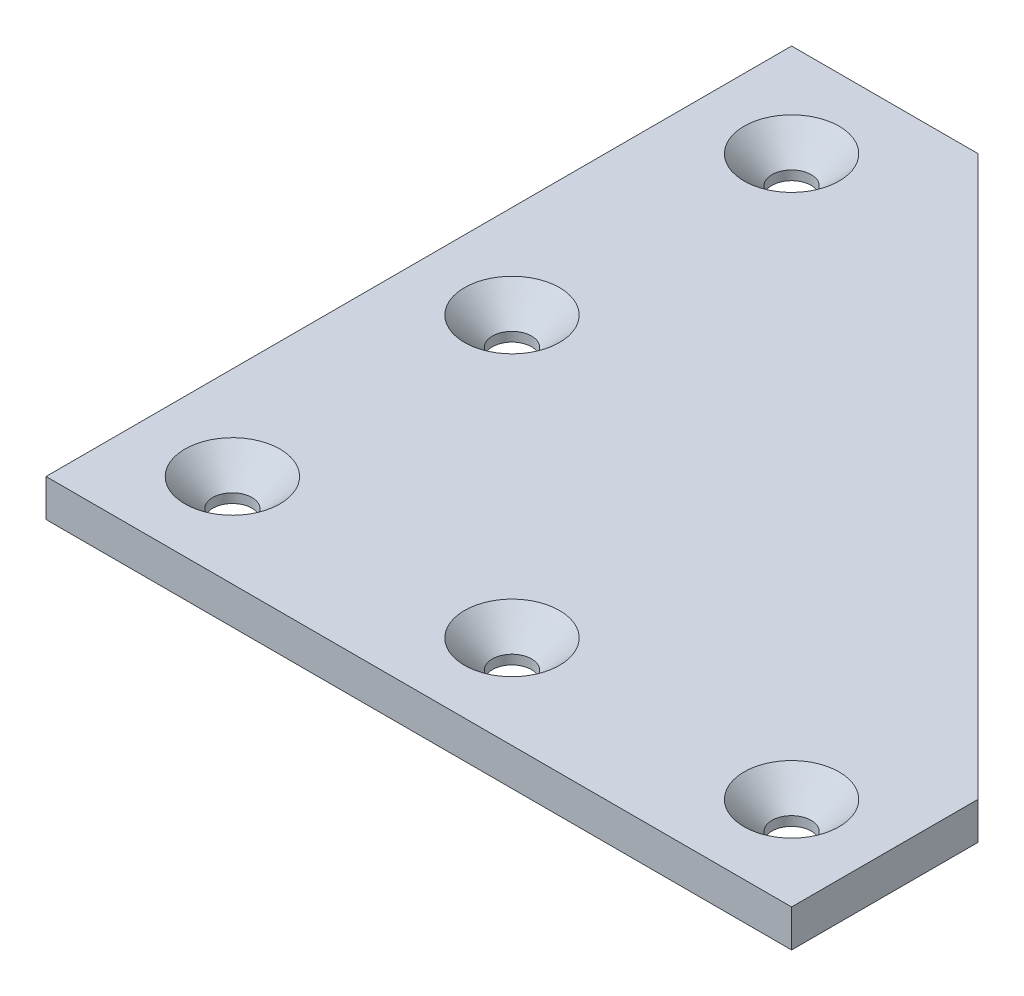
ISO-10303-21;
HEADER;
FILE_DESCRIPTION(('STEP AP214'),'2;1');
FILE_NAME('part.step','',(''),(''),'','','');
FILE_SCHEMA(('AUTOMOTIVE_DESIGN { 1 0 10303 214 1 1 1 1 }'));
ENDSEC;
DATA;
#1=APPLICATION_CONTEXT('core data for automotive mechanical design processes');
#2=APPLICATION_PROTOCOL_DEFINITION('international standard','automotive_design',2000,#1);
#3=PRODUCT_CONTEXT('',#1,'mechanical');
#4=PRODUCT('Part','Part','',(#3));
#5=PRODUCT_RELATED_PRODUCT_CATEGORY('part','',(#4));
#6=PRODUCT_DEFINITION_FORMATION('','',#4);
#7=PRODUCT_DEFINITION_CONTEXT('part definition',#1,'design');
#8=PRODUCT_DEFINITION('design','',#6,#7);
#9=PRODUCT_DEFINITION_SHAPE('','',#8);
#10=(LENGTH_UNIT() NAMED_UNIT(*) SI_UNIT(.MILLI.,.METRE.));
#11=(NAMED_UNIT(*) PLANE_ANGLE_UNIT() SI_UNIT($,.RADIAN.));
#12=(NAMED_UNIT(*) SI_UNIT($,.STERADIAN.) SOLID_ANGLE_UNIT());
#13=UNCERTAINTY_MEASURE_WITH_UNIT(LENGTH_MEASURE(1.E-05),#10,'distance_accuracy_value','');
#14=(GEOMETRIC_REPRESENTATION_CONTEXT(3) GLOBAL_UNCERTAINTY_ASSIGNED_CONTEXT((#13)) GLOBAL_UNIT_ASSIGNED_CONTEXT((#10,
#11,#12)) REPRESENTATION_CONTEXT('',''));
#15=CARTESIAN_POINT('',(0.,0.,0.));
#16=DIRECTION('',(0.,0.,1.));
#17=DIRECTION('',(1.,0.,0.));
#18=AXIS2_PLACEMENT_3D('',#15,#16,#17);
#19=CARTESIAN_POINT('',(80.,4.,0.));
#20=DIRECTION('',(0.,0.,-1.));
#21=DIRECTION('',(-1.,0.,0.));
#22=AXIS2_PLACEMENT_3D('',#19,#20,#21);
#23=PLANE('',#22);
#24=DIRECTION('',(1.,0.,0.));
#25=VECTOR('',#24,1.);
#26=CARTESIAN_POINT('',(80.,0.,0.));
#27=LINE('',#26,#25);
#28=CARTESIAN_POINT('',(0.,0.,0.));
#29=VERTEX_POINT('',#28);
#30=CARTESIAN_POINT('',(80.,0.,0.));
#31=VERTEX_POINT('',#30);
#32=EDGE_CURVE('E128',#29,#31,#27,.T.);
#33=ORIENTED_EDGE('',*,*,#32,.T.);
#34=DIRECTION('',(0.,-1.,0.));
#35=VECTOR('',#34,1.);
#36=CARTESIAN_POINT('',(80.,4.,0.));
#37=LINE('',#36,#35);
#38=CARTESIAN_POINT('',(80.,4.,0.));
#39=VERTEX_POINT('',#38);
#40=EDGE_CURVE('E149',#39,#31,#37,.T.);
#41=ORIENTED_EDGE('',*,*,#40,.F.);
#42=DIRECTION('',(1.,0.,0.));
#43=VECTOR('',#42,1.);
#44=CARTESIAN_POINT('',(80.,4.,0.));
#45=LINE('',#44,#43);
#46=CARTESIAN_POINT('',(0.,4.,0.));
#47=VERTEX_POINT('',#46);
#48=EDGE_CURVE('E142',#47,#39,#45,.T.);
#49=ORIENTED_EDGE('',*,*,#48,.F.);
#50=DIRECTION('',(0.,-1.,0.));
#51=VECTOR('',#50,1.);
#52=CARTESIAN_POINT('',(0.,4.,0.));
#53=LINE('',#52,#51);
#54=EDGE_CURVE('E124',#47,#29,#53,.T.);
#55=ORIENTED_EDGE('',*,*,#54,.T.);
#56=EDGE_LOOP('',(#33,#41,#49,#55));
#57=FACE_BOUND('',#56,.T.);
#58=ADVANCED_FACE('F45',(#57),#23,.F.);
#59=CARTESIAN_POINT('',(80.,4.,-20.));
#60=DIRECTION('',(-1.,0.,0.));
#61=DIRECTION('',(0.,0.,1.));
#62=AXIS2_PLACEMENT_3D('',#59,#60,#61);
#63=PLANE('',#62);
#64=DIRECTION('',(0.,0.,-1.));
#65=VECTOR('',#64,1.);
#66=CARTESIAN_POINT('',(80.,0.,-20.));
#67=LINE('',#66,#65);
#68=CARTESIAN_POINT('',(80.,0.,-20.));
#69=VERTEX_POINT('',#68);
#70=EDGE_CURVE('E132',#31,#69,#67,.T.);
#71=ORIENTED_EDGE('',*,*,#70,.T.);
#72=DIRECTION('',(0.,-1.,0.));
#73=VECTOR('',#72,1.);
#74=CARTESIAN_POINT('',(80.,4.,-20.));
#75=LINE('',#74,#73);
#76=CARTESIAN_POINT('',(80.,4.,-20.));
#77=VERTEX_POINT('',#76);
#78=EDGE_CURVE('E117',#77,#69,#75,.T.);
#79=ORIENTED_EDGE('',*,*,#78,.F.);
#80=DIRECTION('',(0.,0.,-1.));
#81=VECTOR('',#80,1.);
#82=CARTESIAN_POINT('',(80.,4.,-20.));
#83=LINE('',#82,#81);
#84=EDGE_CURVE('E99',#39,#77,#83,.T.);
#85=ORIENTED_EDGE('',*,*,#84,.F.);
#86=ORIENTED_EDGE('',*,*,#40,.T.);
#87=EDGE_LOOP('',(#71,#79,#85,#86));
#88=FACE_BOUND('',#87,.T.);
#89=ADVANCED_FACE('F205',(#88),#63,.F.);
#90=CARTESIAN_POINT('',(20.,4.,-79.9999999999998));
#91=DIRECTION('',(-0.707106781186546,0.,0.707106781186549));
#92=DIRECTION('',(0.707106781186549,0.,0.707106781186546));
#93=AXIS2_PLACEMENT_3D('',#90,#91,#92);
#94=PLANE('',#93);
#95=DIRECTION('',(-0.707106781186549,0.,-0.707106781186546));
#96=VECTOR('',#95,1.);
#97=CARTESIAN_POINT('',(20.,0.,-79.9999999999998));
#98=LINE('',#97,#96);
#99=CARTESIAN_POINT('',(20.,0.,-79.9999999999998));
#100=VERTEX_POINT('',#99);
#101=EDGE_CURVE('E115',#69,#100,#98,.T.);
#102=ORIENTED_EDGE('',*,*,#101,.T.);
#103=DIRECTION('',(0.,-1.,0.));
#104=VECTOR('',#103,1.);
#105=CARTESIAN_POINT('',(20.,4.,-79.9999999999998));
#106=LINE('',#105,#104);
#107=CARTESIAN_POINT('',(20.,4.,-79.9999999999998));
#108=VERTEX_POINT('',#107);
#109=EDGE_CURVE('E112',#108,#100,#106,.T.);
#110=ORIENTED_EDGE('',*,*,#109,.F.);
#111=DIRECTION('',(-0.707106781186549,0.,-0.707106781186546));
#112=VECTOR('',#111,1.);
#113=CARTESIAN_POINT('',(20.,4.,-79.9999999999998));
#114=LINE('',#113,#112);
#115=EDGE_CURVE('E103',#77,#108,#114,.T.);
#116=ORIENTED_EDGE('',*,*,#115,.F.);
#117=ORIENTED_EDGE('',*,*,#78,.T.);
#118=EDGE_LOOP('',(#102,#110,#116,#117));
#119=FACE_BOUND('',#118,.T.);
#120=ADVANCED_FACE('F113',(#119),#94,.F.);
#121=CARTESIAN_POINT('',(0.,4.,-79.9999999999998));
#122=DIRECTION('',(0.,0.,1.));
#123=DIRECTION('',(1.,0.,0.));
#124=AXIS2_PLACEMENT_3D('',#121,#122,#123);
#125=PLANE('',#124);
#126=DIRECTION('',(-1.,0.,0.));
#127=VECTOR('',#126,1.);
#128=CARTESIAN_POINT('',(0.,0.,-79.9999999999998));
#129=LINE('',#128,#127);
#130=CARTESIAN_POINT('',(0.,0.,-79.9999999999998));
#131=VERTEX_POINT('',#130);
#132=EDGE_CURVE('E84',#100,#131,#129,.T.);
#133=ORIENTED_EDGE('',*,*,#132,.T.);
#134=DIRECTION('',(0.,-1.,0.));
#135=VECTOR('',#134,1.);
#136=CARTESIAN_POINT('',(0.,4.,-79.9999999999998));
#137=LINE('',#136,#135);
#138=CARTESIAN_POINT('',(0.,4.,-79.9999999999998));
#139=VERTEX_POINT('',#138);
#140=EDGE_CURVE('E118',#139,#131,#137,.T.);
#141=ORIENTED_EDGE('',*,*,#140,.F.);
#142=DIRECTION('',(-1.,0.,0.));
#143=VECTOR('',#142,1.);
#144=CARTESIAN_POINT('',(0.,4.,-79.9999999999998));
#145=LINE('',#144,#143);
#146=EDGE_CURVE('E107',#108,#139,#145,.T.);
#147=ORIENTED_EDGE('',*,*,#146,.F.);
#148=ORIENTED_EDGE('',*,*,#109,.T.);
#149=EDGE_LOOP('',(#133,#141,#147,#148));
#150=FACE_BOUND('',#149,.T.);
#151=ADVANCED_FACE('F120',(#150),#125,.F.);
#152=CARTESIAN_POINT('',(0.,4.,0.));
#153=DIRECTION('',(1.,0.,0.));
#154=DIRECTION('',(0.,0.,-1.));
#155=AXIS2_PLACEMENT_3D('',#152,#153,#154);
#156=PLANE('',#155);
#157=DIRECTION('',(0.,0.,1.));
#158=VECTOR('',#157,1.);
#159=CARTESIAN_POINT('',(0.,0.,0.));
#160=LINE('',#159,#158);
#161=EDGE_CURVE('E90',#131,#29,#160,.T.);
#162=ORIENTED_EDGE('',*,*,#161,.T.);
#163=ORIENTED_EDGE('',*,*,#54,.F.);
#164=DIRECTION('',(0.,0.,1.));
#165=VECTOR('',#164,1.);
#166=CARTESIAN_POINT('',(0.,4.,0.));
#167=LINE('',#166,#165);
#168=EDGE_CURVE('E64',#139,#47,#167,.T.);
#169=ORIENTED_EDGE('',*,*,#168,.F.);
#170=ORIENTED_EDGE('',*,*,#140,.T.);
#171=EDGE_LOOP('',(#162,#163,#169,#170));
#172=FACE_BOUND('',#171,.T.);
#173=ADVANCED_FACE('F272',(#172),#156,.F.);
#174=CARTESIAN_POINT('',(0.,4.,0.));
#175=DIRECTION('',(0.,-1.,0.));
#176=DIRECTION('',(0.,0.,-1.));
#177=AXIS2_PLACEMENT_3D('',#174,#175,#176);
#178=PLANE('',#177);
#179=CARTESIAN_POINT('',(70.,4.,-10.));
#180=DIRECTION('',(0.,-1.,0.));
#181=DIRECTION('',(0.,0.,-1.));
#182=AXIS2_PLACEMENT_3D('',#179,#180,#181);
#183=CIRCLE('',#182,5.10000000000002);
#184=CARTESIAN_POINT('',(70.,4.,-15.1));
#185=VERTEX_POINT('',#184);
#186=EDGE_CURVE('E172',#185,#185,#183,.T.);
#187=ORIENTED_EDGE('',*,*,#186,.T.);
#188=EDGE_LOOP('',(#187));
#189=FACE_BOUND('',#188,.T.);
#190=CARTESIAN_POINT('',(40.,4.,-10.));
#191=DIRECTION('',(0.,-1.,0.));
#192=DIRECTION('',(0.,0.,-1.));
#193=AXIS2_PLACEMENT_3D('',#190,#191,#192);
#194=CIRCLE('',#193,5.10000000000001);
#195=CARTESIAN_POINT('',(40.,4.,-15.1));
#196=VERTEX_POINT('',#195);
#197=EDGE_CURVE('E168',#196,#196,#194,.T.);
#198=ORIENTED_EDGE('',*,*,#197,.T.);
#199=EDGE_LOOP('',(#198));
#200=FACE_BOUND('',#199,.T.);
#201=CARTESIAN_POINT('',(10.,4.,-10.));
#202=DIRECTION('',(0.,-1.,0.));
#203=DIRECTION('',(0.,0.,-1.));
#204=AXIS2_PLACEMENT_3D('',#201,#202,#203);
#205=CIRCLE('',#204,5.10000000000004);
#206=CARTESIAN_POINT('',(10.,4.,-15.1));
#207=VERTEX_POINT('',#206);
#208=EDGE_CURVE('E164',#207,#207,#205,.T.);
#209=ORIENTED_EDGE('',*,*,#208,.T.);
#210=EDGE_LOOP('',(#209));
#211=FACE_BOUND('',#210,.T.);
#212=CARTESIAN_POINT('',(9.9999999999999,4.,-40.));
#213=DIRECTION('',(0.,-1.,0.));
#214=DIRECTION('',(0.,0.,-1.));
#215=AXIS2_PLACEMENT_3D('',#212,#213,#214);
#216=CIRCLE('',#215,5.10000000000002);
#217=CARTESIAN_POINT('',(9.9999999999999,4.,-45.1));
#218=VERTEX_POINT('',#217);
#219=EDGE_CURVE('E160',#218,#218,#216,.T.);
#220=ORIENTED_EDGE('',*,*,#219,.T.);
#221=EDGE_LOOP('',(#220));
#222=FACE_BOUND('',#221,.T.);
#223=CARTESIAN_POINT('',(9.99999999999979,4.,-70.));
#224=DIRECTION('',(0.,-1.,0.));
#225=DIRECTION('',(0.,0.,-1.));
#226=AXIS2_PLACEMENT_3D('',#223,#224,#225);
#227=CIRCLE('',#226,5.10000000000001);
#228=CARTESIAN_POINT('',(9.99999999999979,4.,-75.1));
#229=VERTEX_POINT('',#228);
#230=EDGE_CURVE('E156',#229,#229,#227,.T.);
#231=ORIENTED_EDGE('',*,*,#230,.T.);
#232=EDGE_LOOP('',(#231));
#233=FACE_BOUND('',#232,.T.);
#234=ORIENTED_EDGE('',*,*,#48,.T.);
#235=ORIENTED_EDGE('',*,*,#84,.T.);
#236=ORIENTED_EDGE('',*,*,#115,.T.);
#237=ORIENTED_EDGE('',*,*,#146,.T.);
#238=ORIENTED_EDGE('',*,*,#168,.T.);
#239=EDGE_LOOP('',(#234,#235,#236,#237,#238));
#240=FACE_BOUND('',#239,.T.);
#241=ADVANCED_FACE('F105',(#189,#200,#211,#222,#233,#240),#178,.F.);
#242=CARTESIAN_POINT('',(0.,0.,0.));
#243=DIRECTION('',(0.,-1.,0.));
#244=DIRECTION('',(0.,0.,-1.));
#245=AXIS2_PLACEMENT_3D('',#242,#243,#244);
#246=PLANE('',#245);
#247=CARTESIAN_POINT('',(9.99999999999979,0.,-70.));
#248=DIRECTION('',(0.,1.,0.));
#249=DIRECTION('',(0.,0.,1.));
#250=AXIS2_PLACEMENT_3D('',#247,#248,#249);
#251=CIRCLE('',#250,2.1);
#252=CARTESIAN_POINT('',(9.99999999999979,0.,-67.9));
#253=VERTEX_POINT('',#252);
#254=EDGE_CURVE('E258',#253,#253,#251,.T.);
#255=ORIENTED_EDGE('',*,*,#254,.T.);
#256=EDGE_LOOP('',(#255));
#257=FACE_BOUND('',#256,.T.);
#258=CARTESIAN_POINT('',(9.9999999999999,0.,-40.));
#259=DIRECTION('',(0.,1.,0.));
#260=DIRECTION('',(0.,0.,1.));
#261=AXIS2_PLACEMENT_3D('',#258,#259,#260);
#262=CIRCLE('',#261,2.1);
#263=CARTESIAN_POINT('',(9.9999999999999,0.,-37.9));
#264=VERTEX_POINT('',#263);
#265=EDGE_CURVE('E426',#264,#264,#262,.T.);
#266=ORIENTED_EDGE('',*,*,#265,.T.);
#267=EDGE_LOOP('',(#266));
#268=FACE_BOUND('',#267,.T.);
#269=CARTESIAN_POINT('',(70.,0.,-10.));
#270=DIRECTION('',(0.,1.,0.));
#271=DIRECTION('',(0.,0.,1.));
#272=AXIS2_PLACEMENT_3D('',#269,#270,#271);
#273=CIRCLE('',#272,2.1);
#274=CARTESIAN_POINT('',(70.,0.,-7.9));
#275=VERTEX_POINT('',#274);
#276=EDGE_CURVE('E254',#275,#275,#273,.T.);
#277=ORIENTED_EDGE('',*,*,#276,.T.);
#278=EDGE_LOOP('',(#277));
#279=FACE_BOUND('',#278,.T.);
#280=CARTESIAN_POINT('',(10.,0.,-10.));
#281=DIRECTION('',(0.,1.,0.));
#282=DIRECTION('',(0.,0.,1.));
#283=AXIS2_PLACEMENT_3D('',#280,#281,#282);
#284=CIRCLE('',#283,2.1);
#285=CARTESIAN_POINT('',(10.,0.,-7.9));
#286=VERTEX_POINT('',#285);
#287=EDGE_CURVE('E250',#286,#286,#284,.T.);
#288=ORIENTED_EDGE('',*,*,#287,.T.);
#289=EDGE_LOOP('',(#288));
#290=FACE_BOUND('',#289,.T.);
#291=CARTESIAN_POINT('',(40.,0.,-10.));
#292=DIRECTION('',(0.,1.,0.));
#293=DIRECTION('',(0.,0.,1.));
#294=AXIS2_PLACEMENT_3D('',#291,#292,#293);
#295=CIRCLE('',#294,2.1);
#296=CARTESIAN_POINT('',(40.,0.,-7.9));
#297=VERTEX_POINT('',#296);
#298=EDGE_CURVE('E133',#297,#297,#295,.T.);
#299=ORIENTED_EDGE('',*,*,#298,.T.);
#300=EDGE_LOOP('',(#299));
#301=FACE_BOUND('',#300,.T.);
#302=ORIENTED_EDGE('',*,*,#32,.F.);
#303=ORIENTED_EDGE('',*,*,#161,.F.);
#304=ORIENTED_EDGE('',*,*,#132,.F.);
#305=ORIENTED_EDGE('',*,*,#101,.F.);
#306=ORIENTED_EDGE('',*,*,#70,.F.);
#307=EDGE_LOOP('',(#302,#303,#304,#305,#306));
#308=FACE_BOUND('',#307,.T.);
#309=ADVANCED_FACE('F244',(#257,#268,#279,#290,#301,#308),#246,.T.);
#310=CARTESIAN_POINT('',(40.,0.,-10.));
#311=DIRECTION('',(0.,1.,0.));
#312=DIRECTION('',(0.,0.,1.));
#313=AXIS2_PLACEMENT_3D('',#310,#311,#312);
#314=CYLINDRICAL_SURFACE('',#313,2.1);
#315=CARTESIAN_POINT('',(40.,0.999999999999996,-10.));
#316=DIRECTION('',(0.,-1.,0.));
#317=DIRECTION('',(0.,0.,-1.));
#318=AXIS2_PLACEMENT_3D('',#315,#316,#317);
#319=CIRCLE('',#318,2.1);
#320=CARTESIAN_POINT('',(40.,0.999999999999996,-12.1));
#321=VERTEX_POINT('',#320);
#322=EDGE_CURVE('E176',#321,#321,#319,.F.);
#323=ORIENTED_EDGE('',*,*,#322,.T.);
#324=EDGE_LOOP('',(#323));
#325=FACE_BOUND('',#324,.T.);
#326=ORIENTED_EDGE('',*,*,#298,.F.);
#327=EDGE_LOOP('',(#326));
#328=FACE_BOUND('',#327,.T.);
#329=ADVANCED_FACE('F240',(#325,#328),#314,.F.);
#330=CARTESIAN_POINT('',(10.,0.,-10.));
#331=DIRECTION('',(0.,1.,0.));
#332=DIRECTION('',(0.,0.,1.));
#333=AXIS2_PLACEMENT_3D('',#330,#331,#332);
#334=CYLINDRICAL_SURFACE('',#333,2.1);
#335=CARTESIAN_POINT('',(10.,0.99999999999997,-10.));
#336=DIRECTION('',(0.,-1.,0.));
#337=DIRECTION('',(0.,0.,-1.));
#338=AXIS2_PLACEMENT_3D('',#335,#336,#337);
#339=CIRCLE('',#338,2.1);
#340=CARTESIAN_POINT('',(10.,0.99999999999997,-12.1));
#341=VERTEX_POINT('',#340);
#342=EDGE_CURVE('E180',#341,#341,#339,.F.);
#343=ORIENTED_EDGE('',*,*,#342,.T.);
#344=EDGE_LOOP('',(#343));
#345=FACE_BOUND('',#344,.T.);
#346=ORIENTED_EDGE('',*,*,#287,.F.);
#347=EDGE_LOOP('',(#346));
#348=FACE_BOUND('',#347,.T.);
#349=ADVANCED_FACE('F243',(#345,#348),#334,.F.);
#350=CARTESIAN_POINT('',(70.,0.,-10.));
#351=DIRECTION('',(0.,1.,0.));
#352=DIRECTION('',(0.,0.,1.));
#353=AXIS2_PLACEMENT_3D('',#350,#351,#352);
#354=CYLINDRICAL_SURFACE('',#353,2.1);
#355=CARTESIAN_POINT('',(70.,0.99999999999999,-10.));
#356=DIRECTION('',(0.,-1.,0.));
#357=DIRECTION('',(0.,0.,-1.));
#358=AXIS2_PLACEMENT_3D('',#355,#356,#357);
#359=CIRCLE('',#358,2.1);
#360=CARTESIAN_POINT('',(70.,0.99999999999999,-12.1));
#361=VERTEX_POINT('',#360);
#362=EDGE_CURVE('E152',#361,#361,#359,.F.);
#363=ORIENTED_EDGE('',*,*,#362,.T.);
#364=EDGE_LOOP('',(#363));
#365=FACE_BOUND('',#364,.T.);
#366=ORIENTED_EDGE('',*,*,#276,.F.);
#367=EDGE_LOOP('',(#366));
#368=FACE_BOUND('',#367,.T.);
#369=ADVANCED_FACE('F317',(#365,#368),#354,.F.);
#370=CARTESIAN_POINT('',(9.9999999999999,0.,-40.));
#371=DIRECTION('',(0.,1.,0.));
#372=DIRECTION('',(0.,0.,1.));
#373=AXIS2_PLACEMENT_3D('',#370,#371,#372);
#374=CYLINDRICAL_SURFACE('',#373,2.1);
#375=CARTESIAN_POINT('',(9.9999999999999,0.999999999999983,-40.));
#376=DIRECTION('',(0.,-1.,0.));
#377=DIRECTION('',(0.,0.,-1.));
#378=AXIS2_PLACEMENT_3D('',#375,#376,#377);
#379=CIRCLE('',#378,2.1);
#380=CARTESIAN_POINT('',(9.9999999999999,0.999999999999983,-42.1));
#381=VERTEX_POINT('',#380);
#382=EDGE_CURVE('E56',#381,#381,#379,.F.);
#383=ORIENTED_EDGE('',*,*,#382,.T.);
#384=EDGE_LOOP('',(#383));
#385=FACE_BOUND('',#384,.T.);
#386=ORIENTED_EDGE('',*,*,#265,.F.);
#387=EDGE_LOOP('',(#386));
#388=FACE_BOUND('',#387,.T.);
#389=ADVANCED_FACE('F187',(#385,#388),#374,.F.);
#390=CARTESIAN_POINT('',(9.99999999999979,0.,-70.));
#391=DIRECTION('',(0.,1.,0.));
#392=DIRECTION('',(0.,0.,1.));
#393=AXIS2_PLACEMENT_3D('',#390,#391,#392);
#394=CYLINDRICAL_SURFACE('',#393,2.1);
#395=CARTESIAN_POINT('',(9.99999999999979,1.,-70.));
#396=DIRECTION('',(0.,-1.,0.));
#397=DIRECTION('',(0.,0.,-1.));
#398=AXIS2_PLACEMENT_3D('',#395,#396,#397);
#399=CIRCLE('',#398,2.1);
#400=CARTESIAN_POINT('',(9.99999999999979,1.,-72.1));
#401=VERTEX_POINT('',#400);
#402=EDGE_CURVE('E11',#401,#401,#399,.F.);
#403=ORIENTED_EDGE('',*,*,#402,.T.);
#404=EDGE_LOOP('',(#403));
#405=FACE_BOUND('',#404,.T.);
#406=ORIENTED_EDGE('',*,*,#254,.F.);
#407=EDGE_LOOP('',(#406));
#408=FACE_BOUND('',#407,.T.);
#409=ADVANCED_FACE('F221',(#405,#408),#394,.F.);
#410=CARTESIAN_POINT('',(70.,0.99999999999999,-10.));
#411=DIRECTION('',(0.,1.,0.));
#412=DIRECTION('',(0.,0.,1.));
#413=AXIS2_PLACEMENT_3D('',#410,#411,#412);
#414=CONICAL_SURFACE('',#413,2.1,0.785398163397449);
#415=ORIENTED_EDGE('',*,*,#186,.F.);
#416=EDGE_LOOP('',(#415));
#417=FACE_BOUND('',#416,.T.);
#418=ORIENTED_EDGE('',*,*,#362,.F.);
#419=EDGE_LOOP('',(#418));
#420=FACE_BOUND('',#419,.T.);
#421=ADVANCED_FACE('F215',(#417,#420),#414,.F.);
#422=CARTESIAN_POINT('',(40.,0.999999999999996,-10.));
#423=DIRECTION('',(0.,1.,0.));
#424=DIRECTION('',(0.,0.,1.));
#425=AXIS2_PLACEMENT_3D('',#422,#423,#424);
#426=CONICAL_SURFACE('',#425,2.1,0.785398163397449);
#427=ORIENTED_EDGE('',*,*,#197,.F.);
#428=EDGE_LOOP('',(#427));
#429=FACE_BOUND('',#428,.T.);
#430=ORIENTED_EDGE('',*,*,#322,.F.);
#431=EDGE_LOOP('',(#430));
#432=FACE_BOUND('',#431,.T.);
#433=ADVANCED_FACE('F199',(#429,#432),#426,.F.);
#434=CARTESIAN_POINT('',(10.,0.99999999999997,-10.));
#435=DIRECTION('',(0.,1.,0.));
#436=DIRECTION('',(0.,0.,1.));
#437=AXIS2_PLACEMENT_3D('',#434,#435,#436);
#438=CONICAL_SURFACE('',#437,2.1,0.78539816339745);
#439=ORIENTED_EDGE('',*,*,#208,.F.);
#440=EDGE_LOOP('',(#439));
#441=FACE_BOUND('',#440,.T.);
#442=ORIENTED_EDGE('',*,*,#342,.F.);
#443=EDGE_LOOP('',(#442));
#444=FACE_BOUND('',#443,.T.);
#445=ADVANCED_FACE('F192',(#441,#444),#438,.F.);
#446=CARTESIAN_POINT('',(9.9999999999999,0.999999999999984,-40.));
#447=DIRECTION('',(0.,1.,0.));
#448=DIRECTION('',(0.,0.,1.));
#449=AXIS2_PLACEMENT_3D('',#446,#447,#448);
#450=CONICAL_SURFACE('',#449,2.1,0.785398163397449);
#451=ORIENTED_EDGE('',*,*,#219,.F.);
#452=EDGE_LOOP('',(#451));
#453=FACE_BOUND('',#452,.T.);
#454=ORIENTED_EDGE('',*,*,#382,.F.);
#455=EDGE_LOOP('',(#454));
#456=FACE_BOUND('',#455,.T.);
#457=ADVANCED_FACE('F190',(#453,#456),#450,.F.);
#458=CARTESIAN_POINT('',(9.99999999999979,1.,-70.));
#459=DIRECTION('',(0.,1.,0.));
#460=DIRECTION('',(0.,0.,1.));
#461=AXIS2_PLACEMENT_3D('',#458,#459,#460);
#462=CONICAL_SURFACE('',#461,2.1,0.785398163397449);
#463=ORIENTED_EDGE('',*,*,#230,.F.);
#464=EDGE_LOOP('',(#463));
#465=FACE_BOUND('',#464,.T.);
#466=ORIENTED_EDGE('',*,*,#402,.F.);
#467=EDGE_LOOP('',(#466));
#468=FACE_BOUND('',#467,.T.);
#469=ADVANCED_FACE('F48',(#465,#468),#462,.F.);
#470=CLOSED_SHELL('',(#58,#89,#120,#151,#173,#241,#309,#329,#349,#369,#389,#409,#421,#433,#445,
#457,#469));
#471=MANIFOLD_SOLID_BREP('B2',#470);
#472=ADVANCED_BREP_SHAPE_REPRESENTATION('',(#18,#471),#14);
#473=SHAPE_DEFINITION_REPRESENTATION(#9,#472);
ENDSEC;
END-ISO-10303-21;
